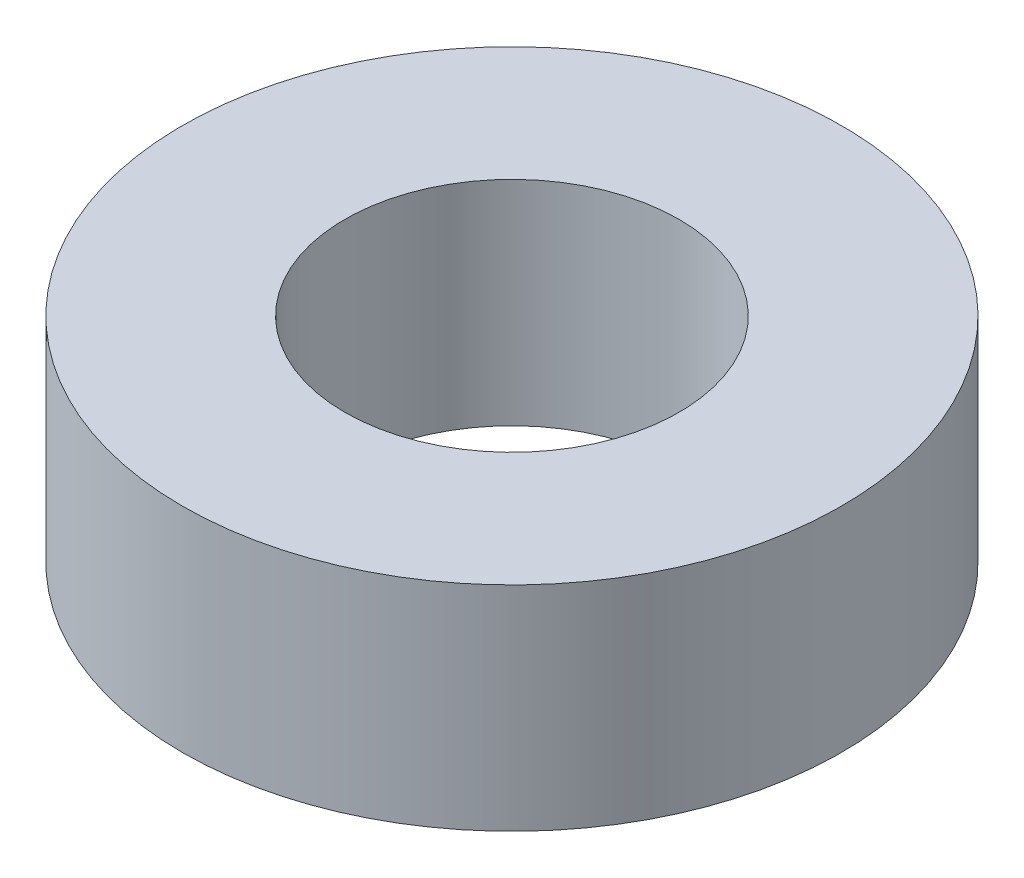
ISO-10303-21;
HEADER;
FILE_DESCRIPTION(('STEP AP214'),'2;1');
FILE_NAME('part.step','',(''),(''),'','','');
FILE_SCHEMA(('AUTOMOTIVE_DESIGN { 1 0 10303 214 1 1 1 1 }'));
ENDSEC;
DATA;
#1=APPLICATION_CONTEXT('core data for automotive mechanical design processes');
#2=APPLICATION_PROTOCOL_DEFINITION('international standard','automotive_design',2000,#1);
#3=PRODUCT_CONTEXT('',#1,'mechanical');
#4=PRODUCT('Part','Part','',(#3));
#5=PRODUCT_RELATED_PRODUCT_CATEGORY('part','',(#4));
#6=PRODUCT_DEFINITION_FORMATION('','',#4);
#7=PRODUCT_DEFINITION_CONTEXT('part definition',#1,'design');
#8=PRODUCT_DEFINITION('design','',#6,#7);
#9=PRODUCT_DEFINITION_SHAPE('','',#8);
#10=(LENGTH_UNIT() NAMED_UNIT(*) SI_UNIT(.MILLI.,.METRE.));
#11=(NAMED_UNIT(*) PLANE_ANGLE_UNIT() SI_UNIT($,.RADIAN.));
#12=(NAMED_UNIT(*) SI_UNIT($,.STERADIAN.) SOLID_ANGLE_UNIT());
#13=UNCERTAINTY_MEASURE_WITH_UNIT(LENGTH_MEASURE(1.E-05),#10,'distance_accuracy_value','');
#14=(GEOMETRIC_REPRESENTATION_CONTEXT(3) GLOBAL_UNCERTAINTY_ASSIGNED_CONTEXT((#13)) GLOBAL_UNIT_ASSIGNED_CONTEXT((#10,
#11,#12)) REPRESENTATION_CONTEXT('',''));
#15=CARTESIAN_POINT('',(0.,0.,0.));
#16=DIRECTION('',(0.,0.,1.));
#17=DIRECTION('',(1.,0.,0.));
#18=AXIS2_PLACEMENT_3D('',#15,#16,#17);
#19=CARTESIAN_POINT('',(0.,9.,0.));
#20=DIRECTION('',(0.,1.,0.));
#21=DIRECTION('',(0.,0.,1.));
#22=AXIS2_PLACEMENT_3D('',#19,#20,#21);
#23=PLANE('',#22);
#24=CARTESIAN_POINT('',(0.,9.,0.));
#25=DIRECTION('',(0.,1.,0.));
#26=DIRECTION('',(0.,0.,1.));
#27=AXIS2_PLACEMENT_3D('',#24,#25,#26);
#28=CIRCLE('',#27,13.9);
#29=CARTESIAN_POINT('',(0.,9.,13.9));
#30=VERTEX_POINT('',#29);
#31=EDGE_CURVE('E10',#30,#30,#28,.T.);
#32=ORIENTED_EDGE('',*,*,#31,.T.);
#33=EDGE_LOOP('',(#32));
#34=FACE_BOUND('',#33,.T.);
#35=CARTESIAN_POINT('',(0.,9.,0.));
#36=DIRECTION('',(0.,1.,0.));
#37=DIRECTION('',(0.,0.,1.));
#38=AXIS2_PLACEMENT_3D('',#35,#36,#37);
#39=CIRCLE('',#38,7.05);
#40=CARTESIAN_POINT('',(0.,9.,7.05));
#41=VERTEX_POINT('',#40);
#42=EDGE_CURVE('E41',#41,#41,#39,.T.);
#43=ORIENTED_EDGE('',*,*,#42,.F.);
#44=EDGE_LOOP('',(#43));
#45=FACE_BOUND('',#44,.T.);
#46=ADVANCED_FACE('F30',(#34,#45),#23,.T.);
#47=CARTESIAN_POINT('',(0.,0.,0.));
#48=DIRECTION('',(0.,1.,0.));
#49=DIRECTION('',(0.,0.,1.));
#50=AXIS2_PLACEMENT_3D('',#47,#48,#49);
#51=PLANE('',#50);
#52=CARTESIAN_POINT('',(0.,0.,0.));
#53=DIRECTION('',(0.,1.,0.));
#54=DIRECTION('',(0.,0.,1.));
#55=AXIS2_PLACEMENT_3D('',#52,#53,#54);
#56=CIRCLE('',#55,13.9);
#57=CARTESIAN_POINT('',(0.,0.,13.9));
#58=VERTEX_POINT('',#57);
#59=EDGE_CURVE('E34',#58,#58,#56,.T.);
#60=ORIENTED_EDGE('',*,*,#59,.F.);
#61=EDGE_LOOP('',(#60));
#62=FACE_BOUND('',#61,.T.);
#63=CARTESIAN_POINT('',(0.,0.,0.));
#64=DIRECTION('',(0.,1.,0.));
#65=DIRECTION('',(0.,0.,1.));
#66=AXIS2_PLACEMENT_3D('',#63,#64,#65);
#67=CIRCLE('',#66,7.05);
#68=CARTESIAN_POINT('',(0.,0.,7.05));
#69=VERTEX_POINT('',#68);
#70=EDGE_CURVE('E43',#69,#69,#67,.T.);
#71=ORIENTED_EDGE('',*,*,#70,.T.);
#72=EDGE_LOOP('',(#71));
#73=FACE_BOUND('',#72,.T.);
#74=ADVANCED_FACE('F53',(#62,#73),#51,.F.);
#75=CARTESIAN_POINT('',(0.,9.,0.));
#76=DIRECTION('',(0.,-1.,0.));
#77=DIRECTION('',(0.,0.,-1.));
#78=AXIS2_PLACEMENT_3D('',#75,#76,#77);
#79=CYLINDRICAL_SURFACE('',#78,13.9);
#80=ORIENTED_EDGE('',*,*,#31,.F.);
#81=EDGE_LOOP('',(#80));
#82=FACE_BOUND('',#81,.T.);
#83=ORIENTED_EDGE('',*,*,#59,.T.);
#84=EDGE_LOOP('',(#83));
#85=FACE_BOUND('',#84,.T.);
#86=ADVANCED_FACE('F32',(#82,#85),#79,.T.);
#87=CARTESIAN_POINT('',(0.,9.,0.));
#88=DIRECTION('',(0.,-1.,0.));
#89=DIRECTION('',(0.,0.,-1.));
#90=AXIS2_PLACEMENT_3D('',#87,#88,#89);
#91=CYLINDRICAL_SURFACE('',#90,7.05);
#92=ORIENTED_EDGE('',*,*,#42,.T.);
#93=EDGE_LOOP('',(#92));
#94=FACE_BOUND('',#93,.T.);
#95=ORIENTED_EDGE('',*,*,#70,.F.);
#96=EDGE_LOOP('',(#95));
#97=FACE_BOUND('',#96,.T.);
#98=ADVANCED_FACE('F49',(#94,#97),#91,.F.);
#99=CLOSED_SHELL('',(#46,#74,#86,#98));
#100=MANIFOLD_SOLID_BREP('B2',#99);
#101=ADVANCED_BREP_SHAPE_REPRESENTATION('',(#18,#100),#14);
#102=SHAPE_DEFINITION_REPRESENTATION(#9,#101);
ENDSEC;
END-ISO-10303-21;
